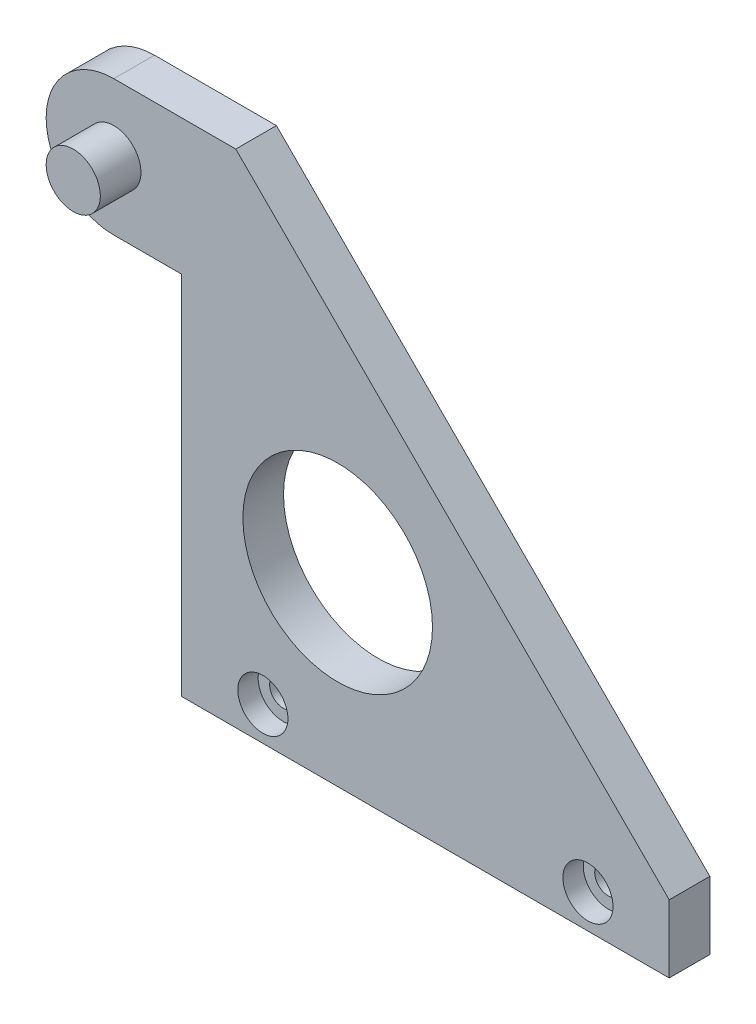
ISO-10303-21;
HEADER;
FILE_DESCRIPTION(('STEP AP214'),'2;1');
FILE_NAME('part.step','',(''),(''),'','','');
FILE_SCHEMA(('AUTOMOTIVE_DESIGN { 1 0 10303 214 1 1 1 1 }'));
ENDSEC;
DATA;
#1=APPLICATION_CONTEXT('core data for automotive mechanical design processes');
#2=APPLICATION_PROTOCOL_DEFINITION('international standard','automotive_design',2000,#1);
#3=PRODUCT_CONTEXT('',#1,'mechanical');
#4=PRODUCT('Part','Part','',(#3));
#5=PRODUCT_RELATED_PRODUCT_CATEGORY('part','',(#4));
#6=PRODUCT_DEFINITION_FORMATION('','',#4);
#7=PRODUCT_DEFINITION_CONTEXT('part definition',#1,'design');
#8=PRODUCT_DEFINITION('design','',#6,#7);
#9=PRODUCT_DEFINITION_SHAPE('','',#8);
#10=(LENGTH_UNIT() NAMED_UNIT(*) SI_UNIT(.MILLI.,.METRE.));
#11=(NAMED_UNIT(*) PLANE_ANGLE_UNIT() SI_UNIT($,.RADIAN.));
#12=(NAMED_UNIT(*) SI_UNIT($,.STERADIAN.) SOLID_ANGLE_UNIT());
#13=UNCERTAINTY_MEASURE_WITH_UNIT(LENGTH_MEASURE(1.E-05),#10,'distance_accuracy_value','');
#14=(GEOMETRIC_REPRESENTATION_CONTEXT(3) GLOBAL_UNCERTAINTY_ASSIGNED_CONTEXT((#13)) GLOBAL_UNIT_ASSIGNED_CONTEXT((#10,
#11,#12)) REPRESENTATION_CONTEXT('',''));
#15=CARTESIAN_POINT('',(0.,0.,0.));
#16=DIRECTION('',(0.,0.,1.));
#17=DIRECTION('',(1.,0.,0.));
#18=AXIS2_PLACEMENT_3D('',#15,#16,#17);
#19=CARTESIAN_POINT('',(-12.,2.49999999999995,0.));
#20=DIRECTION('',(0.,0.,1.));
#21=DIRECTION('',(1.,0.,0.));
#22=AXIS2_PLACEMENT_3D('',#19,#20,#21);
#23=CYLINDRICAL_SURFACE('',#22,1.);
#24=CARTESIAN_POINT('',(-12.,2.49999999999995,0.));
#25=DIRECTION('',(0.,0.,1.));
#26=DIRECTION('',(-1.,0.,0.));
#27=AXIS2_PLACEMENT_3D('',#24,#25,#26);
#28=CIRCLE('',#27,1.);
#29=CARTESIAN_POINT('',(-13.,2.49999999999995,0.));
#30=VERTEX_POINT('',#29);
#31=EDGE_CURVE('E136',#30,#30,#28,.T.);
#32=ORIENTED_EDGE('',*,*,#31,.F.);
#33=EDGE_LOOP('',(#32));
#34=FACE_BOUND('',#33,.T.);
#35=CARTESIAN_POINT('',(-12.,2.49999999999995,1.5));
#36=DIRECTION('',(0.,0.,1.));
#37=DIRECTION('',(1.,0.,0.));
#38=AXIS2_PLACEMENT_3D('',#35,#36,#37);
#39=CIRCLE('',#38,1.);
#40=CARTESIAN_POINT('',(-11.,2.49999999999995,1.5));
#41=VERTEX_POINT('',#40);
#42=EDGE_CURVE('E42',#41,#41,#39,.F.);
#43=ORIENTED_EDGE('',*,*,#42,.F.);
#44=EDGE_LOOP('',(#43));
#45=FACE_BOUND('',#44,.T.);
#46=ADVANCED_FACE('F37',(#34,#45),#23,.F.);
#47=CARTESIAN_POINT('',(12.,2.49999999999995,0.));
#48=DIRECTION('',(0.,0.,1.));
#49=DIRECTION('',(1.,0.,0.));
#50=AXIS2_PLACEMENT_3D('',#47,#48,#49);
#51=CYLINDRICAL_SURFACE('',#50,1.);
#52=CARTESIAN_POINT('',(12.,2.49999999999995,0.));
#53=DIRECTION('',(0.,0.,1.));
#54=DIRECTION('',(1.,0.,0.));
#55=AXIS2_PLACEMENT_3D('',#52,#53,#54);
#56=CIRCLE('',#55,1.);
#57=CARTESIAN_POINT('',(13.,2.49999999999995,0.));
#58=VERTEX_POINT('',#57);
#59=EDGE_CURVE('E151',#58,#58,#56,.T.);
#60=ORIENTED_EDGE('',*,*,#59,.F.);
#61=EDGE_LOOP('',(#60));
#62=FACE_BOUND('',#61,.T.);
#63=CARTESIAN_POINT('',(12.,2.49999999999995,1.5));
#64=DIRECTION('',(0.,0.,1.));
#65=DIRECTION('',(1.,0.,0.));
#66=AXIS2_PLACEMENT_3D('',#63,#64,#65);
#67=CIRCLE('',#66,1.);
#68=CARTESIAN_POINT('',(13.,2.49999999999995,1.5));
#69=VERTEX_POINT('',#68);
#70=EDGE_CURVE('E129',#69,#69,#67,.F.);
#71=ORIENTED_EDGE('',*,*,#70,.F.);
#72=EDGE_LOOP('',(#71));
#73=FACE_BOUND('',#72,.T.);
#74=ADVANCED_FACE('F213',(#62,#73),#51,.F.);
#75=CARTESIAN_POINT('',(-23.,32.,0.));
#76=DIRECTION('',(0.,0.,-1.));
#77=DIRECTION('',(-1.,0.,0.));
#78=AXIS2_PLACEMENT_3D('',#75,#76,#77);
#79=CYLINDRICAL_SURFACE('',#78,5.);
#80=DIRECTION('',(0.,0.,-1.));
#81=VECTOR('',#80,1.);
#82=CARTESIAN_POINT('',(-23.,37.,3.));
#83=LINE('',#82,#81);
#84=CARTESIAN_POINT('',(-23.,37.,0.));
#85=VERTEX_POINT('',#84);
#86=CARTESIAN_POINT('',(-23.,37.,3.));
#87=VERTEX_POINT('',#86);
#88=EDGE_CURVE('E119',#85,#87,#83,.F.);
#89=ORIENTED_EDGE('',*,*,#88,.F.);
#90=CARTESIAN_POINT('',(-23.,32.,0.));
#91=DIRECTION('',(0.,0.,-1.));
#92=DIRECTION('',(-1.,0.,0.));
#93=AXIS2_PLACEMENT_3D('',#90,#91,#92);
#94=CIRCLE('',#93,5.);
#95=CARTESIAN_POINT('',(-23.,27.,0.));
#96=VERTEX_POINT('',#95);
#97=EDGE_CURVE('E47',#96,#85,#94,.T.);
#98=ORIENTED_EDGE('',*,*,#97,.F.);
#99=DIRECTION('',(0.,0.,-1.));
#100=VECTOR('',#99,1.);
#101=CARTESIAN_POINT('',(-23.,27.,3.));
#102=LINE('',#101,#100);
#103=CARTESIAN_POINT('',(-23.,27.,3.));
#104=VERTEX_POINT('',#103);
#105=EDGE_CURVE('E127',#104,#96,#102,.T.);
#106=ORIENTED_EDGE('',*,*,#105,.F.);
#107=CARTESIAN_POINT('',(-23.,32.,3.));
#108=DIRECTION('',(0.,0.,-1.));
#109=DIRECTION('',(-1.,0.,0.));
#110=AXIS2_PLACEMENT_3D('',#107,#108,#109);
#111=CIRCLE('',#110,5.);
#112=EDGE_CURVE('E11',#87,#104,#111,.F.);
#113=ORIENTED_EDGE('',*,*,#112,.F.);
#114=EDGE_LOOP('',(#89,#98,#106,#113));
#115=FACE_BOUND('',#114,.T.);
#116=ADVANCED_FACE('F40',(#115),#79,.T.);
#117=CARTESIAN_POINT('',(-28.,27.,3.));
#118=DIRECTION('',(0.,1.,0.));
#119=DIRECTION('',(-1.,0.,0.));
#120=AXIS2_PLACEMENT_3D('',#117,#118,#119);
#121=PLANE('',#120);
#122=DIRECTION('',(1.,0.,0.));
#123=VECTOR('',#122,1.);
#124=CARTESIAN_POINT('',(-28.,27.,3.));
#125=LINE('',#124,#123);
#126=CARTESIAN_POINT('',(-18.,27.,3.));
#127=VERTEX_POINT('',#126);
#128=EDGE_CURVE('E94',#104,#127,#125,.T.);
#129=ORIENTED_EDGE('',*,*,#128,.F.);
#130=ORIENTED_EDGE('',*,*,#105,.T.);
#131=DIRECTION('',(1.,0.,0.));
#132=VECTOR('',#131,1.);
#133=CARTESIAN_POINT('',(-28.,27.,0.));
#134=LINE('',#133,#132);
#135=CARTESIAN_POINT('',(-18.,27.,0.));
#136=VERTEX_POINT('',#135);
#137=EDGE_CURVE('E114',#96,#136,#134,.T.);
#138=ORIENTED_EDGE('',*,*,#137,.T.);
#139=DIRECTION('',(0.,0.,-1.));
#140=VECTOR('',#139,1.);
#141=CARTESIAN_POINT('',(-18.,27.,3.));
#142=LINE('',#141,#140);
#143=EDGE_CURVE('E106',#127,#136,#142,.T.);
#144=ORIENTED_EDGE('',*,*,#143,.F.);
#145=EDGE_LOOP('',(#129,#130,#138,#144));
#146=FACE_BOUND('',#145,.T.);
#147=ADVANCED_FACE('F112',(#146),#121,.F.);
#148=CARTESIAN_POINT('',(-18.,27.,3.));
#149=DIRECTION('',(1.,0.,0.));
#150=DIRECTION('',(0.,1.,0.));
#151=AXIS2_PLACEMENT_3D('',#148,#149,#150);
#152=PLANE('',#151);
#153=DIRECTION('',(0.,-1.,0.));
#154=VECTOR('',#153,1.);
#155=CARTESIAN_POINT('',(-18.,27.,0.));
#156=LINE('',#155,#154);
#157=CARTESIAN_POINT('',(-18.,0.,0.));
#158=VERTEX_POINT('',#157);
#159=EDGE_CURVE('E169',#136,#158,#156,.T.);
#160=ORIENTED_EDGE('',*,*,#159,.T.);
#161=DIRECTION('',(0.,0.,-1.));
#162=VECTOR('',#161,1.);
#163=CARTESIAN_POINT('',(-18.,0.,3.));
#164=LINE('',#163,#162);
#165=CARTESIAN_POINT('',(-18.,0.,3.));
#166=VERTEX_POINT('',#165);
#167=EDGE_CURVE('E108',#166,#158,#164,.T.);
#168=ORIENTED_EDGE('',*,*,#167,.F.);
#169=DIRECTION('',(0.,-1.,0.));
#170=VECTOR('',#169,1.);
#171=CARTESIAN_POINT('',(-18.,27.,3.));
#172=LINE('',#171,#170);
#173=EDGE_CURVE('E97',#127,#166,#172,.T.);
#174=ORIENTED_EDGE('',*,*,#173,.F.);
#175=ORIENTED_EDGE('',*,*,#143,.T.);
#176=EDGE_LOOP('',(#160,#168,#174,#175));
#177=FACE_BOUND('',#176,.T.);
#178=ADVANCED_FACE('F105',(#177),#152,.F.);
#179=CARTESIAN_POINT('',(-18.,0.,3.));
#180=DIRECTION('',(0.,1.,0.));
#181=DIRECTION('',(-1.,0.,0.));
#182=AXIS2_PLACEMENT_3D('',#179,#180,#181);
#183=PLANE('',#182);
#184=DIRECTION('',(1.,0.,0.));
#185=VECTOR('',#184,1.);
#186=CARTESIAN_POINT('',(-18.,0.,0.));
#187=LINE('',#186,#185);
#188=CARTESIAN_POINT('',(18.,0.,0.));
#189=VERTEX_POINT('',#188);
#190=EDGE_CURVE('E171',#158,#189,#187,.T.);
#191=ORIENTED_EDGE('',*,*,#190,.T.);
#192=DIRECTION('',(0.,0.,-1.));
#193=VECTOR('',#192,1.);
#194=CARTESIAN_POINT('',(18.,0.,3.));
#195=LINE('',#194,#193);
#196=CARTESIAN_POINT('',(18.,0.,3.));
#197=VERTEX_POINT('',#196);
#198=EDGE_CURVE('E121',#197,#189,#195,.T.);
#199=ORIENTED_EDGE('',*,*,#198,.F.);
#200=DIRECTION('',(1.,0.,0.));
#201=VECTOR('',#200,1.);
#202=CARTESIAN_POINT('',(-18.,0.,3.));
#203=LINE('',#202,#201);
#204=EDGE_CURVE('E110',#166,#197,#203,.T.);
#205=ORIENTED_EDGE('',*,*,#204,.F.);
#206=ORIENTED_EDGE('',*,*,#167,.T.);
#207=EDGE_LOOP('',(#191,#199,#205,#206));
#208=FACE_BOUND('',#207,.T.);
#209=ADVANCED_FACE('F203',(#208),#183,.F.);
#210=CARTESIAN_POINT('',(18.,0.,3.));
#211=DIRECTION('',(-1.,0.,0.));
#212=DIRECTION('',(0.,0.,1.));
#213=AXIS2_PLACEMENT_3D('',#210,#211,#212);
#214=PLANE('',#213);
#215=DIRECTION('',(0.,1.,0.));
#216=VECTOR('',#215,1.);
#217=CARTESIAN_POINT('',(18.,0.,0.));
#218=LINE('',#217,#216);
#219=CARTESIAN_POINT('',(18.,5.00000000000001,0.));
#220=VERTEX_POINT('',#219);
#221=EDGE_CURVE('E173',#189,#220,#218,.T.);
#222=ORIENTED_EDGE('',*,*,#221,.T.);
#223=DIRECTION('',(0.,0.,-1.));
#224=VECTOR('',#223,1.);
#225=CARTESIAN_POINT('',(18.,5.00000000000001,3.));
#226=LINE('',#225,#224);
#227=CARTESIAN_POINT('',(18.,5.00000000000001,3.));
#228=VERTEX_POINT('',#227);
#229=EDGE_CURVE('E181',#228,#220,#226,.T.);
#230=ORIENTED_EDGE('',*,*,#229,.F.);
#231=DIRECTION('',(0.,1.,0.));
#232=VECTOR('',#231,1.);
#233=CARTESIAN_POINT('',(18.,0.,3.));
#234=LINE('',#233,#232);
#235=EDGE_CURVE('E161',#197,#228,#234,.T.);
#236=ORIENTED_EDGE('',*,*,#235,.F.);
#237=ORIENTED_EDGE('',*,*,#198,.T.);
#238=EDGE_LOOP('',(#222,#230,#236,#237));
#239=FACE_BOUND('',#238,.T.);
#240=ADVANCED_FACE('F188',(#239),#214,.F.);
#241=CARTESIAN_POINT('',(18.,5.00000000000001,3.));
#242=DIRECTION('',(-0.707106781186548,-0.707106781186547,0.));
#243=DIRECTION('',(0.707106781186547,-0.707106781186548,0.));
#244=AXIS2_PLACEMENT_3D('',#241,#242,#243);
#245=PLANE('',#244);
#246=DIRECTION('',(-0.707106781186547,0.707106781186548,0.));
#247=VECTOR('',#246,1.);
#248=CARTESIAN_POINT('',(18.,5.00000000000001,0.));
#249=LINE('',#248,#247);
#250=CARTESIAN_POINT('',(-13.9999999999999,37.,0.));
#251=VERTEX_POINT('',#250);
#252=EDGE_CURVE('E175',#220,#251,#249,.T.);
#253=ORIENTED_EDGE('',*,*,#252,.T.);
#254=DIRECTION('',(0.,0.,-1.));
#255=VECTOR('',#254,1.);
#256=CARTESIAN_POINT('',(-13.9999999999999,37.,3.));
#257=LINE('',#256,#255);
#258=CARTESIAN_POINT('',(-13.9999999999999,37.,3.));
#259=VERTEX_POINT('',#258);
#260=EDGE_CURVE('E167',#259,#251,#257,.T.);
#261=ORIENTED_EDGE('',*,*,#260,.F.);
#262=DIRECTION('',(-0.707106781186547,0.707106781186548,0.));
#263=VECTOR('',#262,1.);
#264=CARTESIAN_POINT('',(18.,5.00000000000001,3.));
#265=LINE('',#264,#263);
#266=EDGE_CURVE('E163',#228,#259,#265,.T.);
#267=ORIENTED_EDGE('',*,*,#266,.F.);
#268=ORIENTED_EDGE('',*,*,#229,.T.);
#269=EDGE_LOOP('',(#253,#261,#267,#268));
#270=FACE_BOUND('',#269,.T.);
#271=ADVANCED_FACE('F198',(#270),#245,.F.);
#272=CARTESIAN_POINT('',(-13.9999999999999,37.,3.));
#273=DIRECTION('',(0.,-1.,0.));
#274=DIRECTION('',(1.,0.,0.));
#275=AXIS2_PLACEMENT_3D('',#272,#273,#274);
#276=PLANE('',#275);
#277=DIRECTION('',(-1.,0.,0.));
#278=VECTOR('',#277,1.);
#279=CARTESIAN_POINT('',(-13.9999999999999,37.,0.));
#280=LINE('',#279,#278);
#281=EDGE_CURVE('E101',#251,#85,#280,.T.);
#282=ORIENTED_EDGE('',*,*,#281,.T.);
#283=ORIENTED_EDGE('',*,*,#88,.T.);
#284=DIRECTION('',(-1.,0.,0.));
#285=VECTOR('',#284,1.);
#286=CARTESIAN_POINT('',(-13.9999999999999,37.,3.));
#287=LINE('',#286,#285);
#288=EDGE_CURVE('E165',#259,#87,#287,.T.);
#289=ORIENTED_EDGE('',*,*,#288,.F.);
#290=ORIENTED_EDGE('',*,*,#260,.T.);
#291=EDGE_LOOP('',(#282,#283,#289,#290));
#292=FACE_BOUND('',#291,.T.);
#293=ADVANCED_FACE('F202',(#292),#276,.F.);
#294=CARTESIAN_POINT('',(0.,0.,3.));
#295=DIRECTION('',(0.,0.,-1.));
#296=DIRECTION('',(-1.,0.,0.));
#297=AXIS2_PLACEMENT_3D('',#294,#295,#296);
#298=PLANE('',#297);
#299=CARTESIAN_POINT('',(-12.,2.49999999999995,3.));
#300=DIRECTION('',(0.,0.,1.));
#301=DIRECTION('',(1.,0.,0.));
#302=AXIS2_PLACEMENT_3D('',#299,#300,#301);
#303=CIRCLE('',#302,1.85);
#304=CARTESIAN_POINT('',(-10.15,2.49999999999995,3.));
#305=VERTEX_POINT('',#304);
#306=EDGE_CURVE('E146',#305,#305,#303,.T.);
#307=ORIENTED_EDGE('',*,*,#306,.F.);
#308=EDGE_LOOP('',(#307));
#309=FACE_BOUND('',#308,.T.);
#310=CARTESIAN_POINT('',(12.,2.49999999999995,3.));
#311=DIRECTION('',(0.,0.,1.));
#312=DIRECTION('',(1.,0.,0.));
#313=AXIS2_PLACEMENT_3D('',#310,#311,#312);
#314=CIRCLE('',#313,1.85);
#315=CARTESIAN_POINT('',(13.85,2.49999999999995,3.));
#316=VERTEX_POINT('',#315);
#317=EDGE_CURVE('E139',#316,#316,#314,.T.);
#318=ORIENTED_EDGE('',*,*,#317,.F.);
#319=EDGE_LOOP('',(#318));
#320=FACE_BOUND('',#319,.T.);
#321=CARTESIAN_POINT('',(-23.,32.,3.));
#322=DIRECTION('',(0.,0.,-1.));
#323=DIRECTION('',(-1.,0.,0.));
#324=AXIS2_PLACEMENT_3D('',#321,#322,#323);
#325=CIRCLE('',#324,2.);
#326=CARTESIAN_POINT('',(-25.,32.,3.));
#327=VERTEX_POINT('',#326);
#328=EDGE_CURVE('E116',#327,#327,#325,.F.);
#329=ORIENTED_EDGE('',*,*,#328,.F.);
#330=EDGE_LOOP('',(#329));
#331=FACE_BOUND('',#330,.T.);
#332=CARTESIAN_POINT('',(-6.47635753390574,13.6875392105491,3.));
#333=DIRECTION('',(0.,0.,1.));
#334=DIRECTION('',(1.,0.,0.));
#335=AXIS2_PLACEMENT_3D('',#332,#333,#334);
#336=CIRCLE('',#335,7.);
#337=CARTESIAN_POINT('',(0.523642466094258,13.6875392105491,3.));
#338=VERTEX_POINT('',#337);
#339=EDGE_CURVE('E154',#338,#338,#336,.T.);
#340=ORIENTED_EDGE('',*,*,#339,.F.);
#341=EDGE_LOOP('',(#340));
#342=FACE_BOUND('',#341,.T.);
#343=ORIENTED_EDGE('',*,*,#288,.T.);
#344=ORIENTED_EDGE('',*,*,#112,.T.);
#345=ORIENTED_EDGE('',*,*,#128,.T.);
#346=ORIENTED_EDGE('',*,*,#173,.T.);
#347=ORIENTED_EDGE('',*,*,#204,.T.);
#348=ORIENTED_EDGE('',*,*,#235,.T.);
#349=ORIENTED_EDGE('',*,*,#266,.T.);
#350=EDGE_LOOP('',(#343,#344,#345,#346,#347,#348,#349));
#351=FACE_BOUND('',#350,.T.);
#352=ADVANCED_FACE('F96',(#309,#320,#331,#342,#351),#298,.F.);
#353=CARTESIAN_POINT('',(0.,0.,0.));
#354=DIRECTION('',(0.,0.,-1.));
#355=DIRECTION('',(-1.,0.,0.));
#356=AXIS2_PLACEMENT_3D('',#353,#354,#355);
#357=PLANE('',#356);
#358=ORIENTED_EDGE('',*,*,#31,.T.);
#359=EDGE_LOOP('',(#358));
#360=FACE_BOUND('',#359,.T.);
#361=ORIENTED_EDGE('',*,*,#59,.T.);
#362=EDGE_LOOP('',(#361));
#363=FACE_BOUND('',#362,.T.);
#364=CARTESIAN_POINT('',(-6.47635753390574,13.6875392105491,0.));
#365=DIRECTION('',(0.,0.,1.));
#366=DIRECTION('',(1.,0.,0.));
#367=AXIS2_PLACEMENT_3D('',#364,#365,#366);
#368=CIRCLE('',#367,7.);
#369=CARTESIAN_POINT('',(0.523642466094258,13.6875392105491,0.));
#370=VERTEX_POINT('',#369);
#371=EDGE_CURVE('E155',#370,#370,#368,.T.);
#372=ORIENTED_EDGE('',*,*,#371,.T.);
#373=EDGE_LOOP('',(#372));
#374=FACE_BOUND('',#373,.T.);
#375=ORIENTED_EDGE('',*,*,#137,.F.);
#376=ORIENTED_EDGE('',*,*,#97,.T.);
#377=ORIENTED_EDGE('',*,*,#281,.F.);
#378=ORIENTED_EDGE('',*,*,#252,.F.);
#379=ORIENTED_EDGE('',*,*,#221,.F.);
#380=ORIENTED_EDGE('',*,*,#190,.F.);
#381=ORIENTED_EDGE('',*,*,#159,.F.);
#382=EDGE_LOOP('',(#375,#376,#377,#378,#379,#380,#381));
#383=FACE_BOUND('',#382,.T.);
#384=ADVANCED_FACE('F194',(#360,#363,#374,#383),#357,.T.);
#385=CARTESIAN_POINT('',(-6.47635753390574,13.6875392105491,0.));
#386=DIRECTION('',(0.,0.,1.));
#387=DIRECTION('',(1.,0.,0.));
#388=AXIS2_PLACEMENT_3D('',#385,#386,#387);
#389=CYLINDRICAL_SURFACE('',#388,7.);
#390=ORIENTED_EDGE('',*,*,#371,.F.);
#391=EDGE_LOOP('',(#390));
#392=FACE_BOUND('',#391,.T.);
#393=ORIENTED_EDGE('',*,*,#339,.T.);
#394=EDGE_LOOP('',(#393));
#395=FACE_BOUND('',#394,.T.);
#396=ADVANCED_FACE('F227',(#392,#395),#389,.F.);
#397=CARTESIAN_POINT('',(-23.,32.,6.));
#398=DIRECTION('',(0.,0.,-1.));
#399=DIRECTION('',(-1.,0.,0.));
#400=AXIS2_PLACEMENT_3D('',#397,#398,#399);
#401=CYLINDRICAL_SURFACE('',#400,2.);
#402=CARTESIAN_POINT('',(-23.,32.,6.));
#403=DIRECTION('',(0.,0.,1.));
#404=DIRECTION('',(1.,0.,0.));
#405=AXIS2_PLACEMENT_3D('',#402,#403,#404);
#406=CIRCLE('',#405,2.);
#407=CARTESIAN_POINT('',(-21.,32.,6.));
#408=VERTEX_POINT('',#407);
#409=EDGE_CURVE('E131',#408,#408,#406,.T.);
#410=ORIENTED_EDGE('',*,*,#409,.F.);
#411=EDGE_LOOP('',(#410));
#412=FACE_BOUND('',#411,.T.);
#413=ORIENTED_EDGE('',*,*,#328,.T.);
#414=EDGE_LOOP('',(#413));
#415=FACE_BOUND('',#414,.T.);
#416=ADVANCED_FACE('F224',(#412,#415),#401,.T.);
#417=CARTESIAN_POINT('',(-23.,32.,6.));
#418=DIRECTION('',(0.,0.,1.));
#419=DIRECTION('',(1.,0.,0.));
#420=AXIS2_PLACEMENT_3D('',#417,#418,#419);
#421=PLANE('',#420);
#422=ORIENTED_EDGE('',*,*,#409,.T.);
#423=EDGE_LOOP('',(#422));
#424=FACE_BOUND('',#423,.T.);
#425=ADVANCED_FACE('F269',(#424),#421,.T.);
#426=CARTESIAN_POINT('',(12.,2.49999999999995,1.5));
#427=DIRECTION('',(0.,0.,1.));
#428=DIRECTION('',(1.,0.,0.));
#429=AXIS2_PLACEMENT_3D('',#426,#427,#428);
#430=PLANE('',#429);
#431=CARTESIAN_POINT('',(12.,2.49999999999995,1.5));
#432=DIRECTION('',(0.,0.,1.));
#433=DIRECTION('',(1.,0.,0.));
#434=AXIS2_PLACEMENT_3D('',#431,#432,#433);
#435=CIRCLE('',#434,1.85);
#436=CARTESIAN_POINT('',(13.85,2.49999999999995,1.5));
#437=VERTEX_POINT('',#436);
#438=EDGE_CURVE('E132',#437,#437,#435,.T.);
#439=ORIENTED_EDGE('',*,*,#438,.T.);
#440=EDGE_LOOP('',(#439));
#441=FACE_BOUND('',#440,.T.);
#442=ORIENTED_EDGE('',*,*,#70,.T.);
#443=EDGE_LOOP('',(#442));
#444=FACE_BOUND('',#443,.T.);
#445=ADVANCED_FACE('F276',(#441,#444),#430,.T.);
#446=CARTESIAN_POINT('',(12.,2.49999999999995,1.5));
#447=DIRECTION('',(0.,0.,1.));
#448=DIRECTION('',(1.,0.,0.));
#449=AXIS2_PLACEMENT_3D('',#446,#447,#448);
#450=CYLINDRICAL_SURFACE('',#449,1.85);
#451=ORIENTED_EDGE('',*,*,#438,.F.);
#452=EDGE_LOOP('',(#451));
#453=FACE_BOUND('',#452,.T.);
#454=ORIENTED_EDGE('',*,*,#317,.T.);
#455=EDGE_LOOP('',(#454));
#456=FACE_BOUND('',#455,.T.);
#457=ADVANCED_FACE('F283',(#453,#456),#450,.F.);
#458=CARTESIAN_POINT('',(-12.,2.49999999999995,1.5));
#459=DIRECTION('',(0.,0.,1.));
#460=DIRECTION('',(1.,0.,0.));
#461=AXIS2_PLACEMENT_3D('',#458,#459,#460);
#462=PLANE('',#461);
#463=CARTESIAN_POINT('',(-12.,2.49999999999995,1.5));
#464=DIRECTION('',(0.,0.,1.));
#465=DIRECTION('',(1.,0.,0.));
#466=AXIS2_PLACEMENT_3D('',#463,#464,#465);
#467=CIRCLE('',#466,1.85);
#468=CARTESIAN_POINT('',(-10.15,2.49999999999995,1.5));
#469=VERTEX_POINT('',#468);
#470=EDGE_CURVE('E369',#469,#469,#467,.T.);
#471=ORIENTED_EDGE('',*,*,#470,.T.);
#472=EDGE_LOOP('',(#471));
#473=FACE_BOUND('',#472,.T.);
#474=ORIENTED_EDGE('',*,*,#42,.T.);
#475=EDGE_LOOP('',(#474));
#476=FACE_BOUND('',#475,.T.);
#477=ADVANCED_FACE('F290',(#473,#476),#462,.T.);
#478=CARTESIAN_POINT('',(-12.,2.49999999999995,1.5));
#479=DIRECTION('',(0.,0.,1.));
#480=DIRECTION('',(1.,0.,0.));
#481=AXIS2_PLACEMENT_3D('',#478,#479,#480);
#482=CYLINDRICAL_SURFACE('',#481,1.85);
#483=ORIENTED_EDGE('',*,*,#470,.F.);
#484=EDGE_LOOP('',(#483));
#485=FACE_BOUND('',#484,.T.);
#486=ORIENTED_EDGE('',*,*,#306,.T.);
#487=EDGE_LOOP('',(#486));
#488=FACE_BOUND('',#487,.T.);
#489=ADVANCED_FACE('F298',(#485,#488),#482,.F.);
#490=CLOSED_SHELL('',(#46,#74,#116,#147,#178,#209,#240,#271,#293,#352,#384,#396,#416,#425,#445,
#457,#477,#489));
#491=MANIFOLD_SOLID_BREP('B2',#490);
#492=ADVANCED_BREP_SHAPE_REPRESENTATION('',(#18,#491),#14);
#493=SHAPE_DEFINITION_REPRESENTATION(#9,#492);
ENDSEC;
END-ISO-10303-21;
